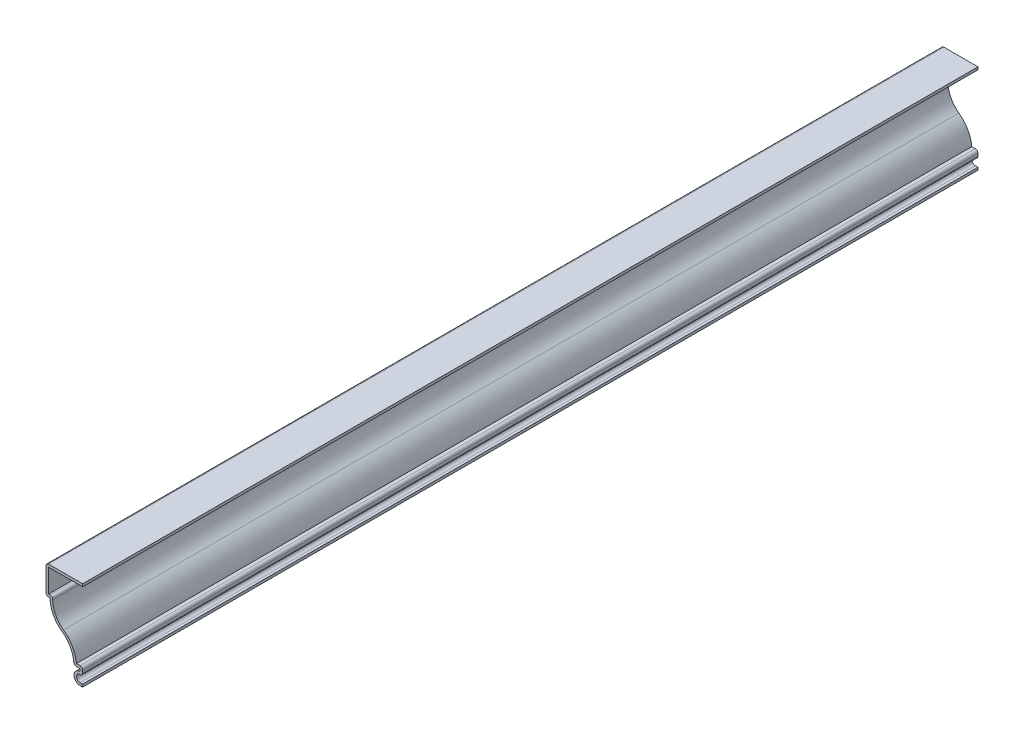
ISO-10303-21;
HEADER;
FILE_DESCRIPTION(('STEP AP214'),'2;1');
FILE_NAME('part.step','',(''),(''),'','','');
FILE_SCHEMA(('AUTOMOTIVE_DESIGN { 1 0 10303 214 1 1 1 1 }'));
ENDSEC;
DATA;
#1=APPLICATION_CONTEXT('core data for automotive mechanical design processes');
#2=APPLICATION_PROTOCOL_DEFINITION('international standard','automotive_design',2000,#1);
#3=PRODUCT_CONTEXT('',#1,'mechanical');
#4=PRODUCT('Part','Part','',(#3));
#5=PRODUCT_RELATED_PRODUCT_CATEGORY('part','',(#4));
#6=PRODUCT_DEFINITION_FORMATION('','',#4);
#7=PRODUCT_DEFINITION_CONTEXT('part definition',#1,'design');
#8=PRODUCT_DEFINITION('design','',#6,#7);
#9=PRODUCT_DEFINITION_SHAPE('','',#8);
#10=(LENGTH_UNIT() NAMED_UNIT(*) SI_UNIT(.MILLI.,.METRE.));
#11=(NAMED_UNIT(*) PLANE_ANGLE_UNIT() SI_UNIT($,.RADIAN.));
#12=(NAMED_UNIT(*) SI_UNIT($,.STERADIAN.) SOLID_ANGLE_UNIT());
#13=UNCERTAINTY_MEASURE_WITH_UNIT(LENGTH_MEASURE(1.E-05),#10,'distance_accuracy_value','');
#14=(GEOMETRIC_REPRESENTATION_CONTEXT(3) GLOBAL_UNCERTAINTY_ASSIGNED_CONTEXT((#13)) GLOBAL_UNIT_ASSIGNED_CONTEXT((#10,
#11,#12)) REPRESENTATION_CONTEXT('',''));
#15=CARTESIAN_POINT('',(0.,0.,0.));
#16=DIRECTION('',(0.,0.,1.));
#17=DIRECTION('',(1.,0.,0.));
#18=AXIS2_PLACEMENT_3D('',#15,#16,#17);
#19=CARTESIAN_POINT('',(-14.2875,33.909,-349.25));
#20=DIRECTION('',(0.,-1.,0.));
#21=DIRECTION('',(1.,0.,0.));
#22=AXIS2_PLACEMENT_3D('',#19,#20,#21);
#23=PLANE('',#22);
#24=DIRECTION('',(1.,0.,0.));
#25=VECTOR('',#24,1.);
#26=CARTESIAN_POINT('',(-14.2875,33.909,0.));
#27=LINE('',#26,#25);
#28=CARTESIAN_POINT('',(-13.2715,33.909,0.));
#29=VERTEX_POINT('',#28);
#30=CARTESIAN_POINT('',(0.,33.909,0.));
#31=VERTEX_POINT('',#30);
#32=EDGE_CURVE('E281',#29,#31,#27,.T.);
#33=ORIENTED_EDGE('',*,*,#32,.F.);
#34=DIRECTION('',(0.,0.,1.));
#35=VECTOR('',#34,1.);
#36=CARTESIAN_POINT('',(-13.2715,33.909,-349.25));
#37=LINE('',#36,#35);
#38=CARTESIAN_POINT('',(-13.2715,33.909,-349.25));
#39=VERTEX_POINT('',#38);
#40=EDGE_CURVE('E233',#39,#29,#37,.T.);
#41=ORIENTED_EDGE('',*,*,#40,.F.);
#42=DIRECTION('',(1.,0.,0.));
#43=VECTOR('',#42,1.);
#44=CARTESIAN_POINT('',(-14.2875,33.909,-349.25));
#45=LINE('',#44,#43);
#46=CARTESIAN_POINT('',(0.,33.909,-349.25));
#47=VERTEX_POINT('',#46);
#48=EDGE_CURVE('E215',#39,#47,#45,.T.);
#49=ORIENTED_EDGE('',*,*,#48,.T.);
#50=DIRECTION('',(0.,0.,1.));
#51=VECTOR('',#50,1.);
#52=CARTESIAN_POINT('',(0.,33.909,-349.25));
#53=LINE('',#52,#51);
#54=EDGE_CURVE('E223',#47,#31,#53,.T.);
#55=ORIENTED_EDGE('',*,*,#54,.T.);
#56=EDGE_LOOP('',(#33,#41,#49,#55));
#57=FACE_BOUND('',#56,.T.);
#58=ADVANCED_FACE('F35',(#57),#23,.T.);
#59=CARTESIAN_POINT('',(-13.2715,23.8125,-349.25));
#60=DIRECTION('',(1.,0.,0.));
#61=DIRECTION('',(0.,1.,0.));
#62=AXIS2_PLACEMENT_3D('',#59,#60,#61);
#63=PLANE('',#62);
#64=DIRECTION('',(0.,1.,0.));
#65=VECTOR('',#64,1.);
#66=CARTESIAN_POINT('',(-13.2715,23.8125,0.));
#67=LINE('',#66,#65);
#68=CARTESIAN_POINT('',(-13.2715,24.8285,0.));
#69=VERTEX_POINT('',#68);
#70=EDGE_CURVE('E234',#69,#29,#67,.T.);
#71=ORIENTED_EDGE('',*,*,#70,.F.);
#72=DIRECTION('',(0.,0.,1.));
#73=VECTOR('',#72,1.);
#74=CARTESIAN_POINT('',(-13.2715,24.8285,-349.25));
#75=LINE('',#74,#73);
#76=CARTESIAN_POINT('',(-13.2715,24.8285,-349.25));
#77=VERTEX_POINT('',#76);
#78=EDGE_CURVE('E326',#77,#69,#75,.T.);
#79=ORIENTED_EDGE('',*,*,#78,.F.);
#80=DIRECTION('',(0.,1.,0.));
#81=VECTOR('',#80,1.);
#82=CARTESIAN_POINT('',(-13.2715,23.8125,-349.25));
#83=LINE('',#82,#81);
#84=EDGE_CURVE('E231',#77,#39,#83,.T.);
#85=ORIENTED_EDGE('',*,*,#84,.T.);
#86=ORIENTED_EDGE('',*,*,#40,.T.);
#87=EDGE_LOOP('',(#71,#79,#85,#86));
#88=FACE_BOUND('',#87,.T.);
#89=ADVANCED_FACE('F426',(#88),#63,.T.);
#90=CARTESIAN_POINT('',(-12.7,24.8285,-349.25));
#91=DIRECTION('',(0.,1.,0.));
#92=DIRECTION('',(-1.,0.,0.));
#93=AXIS2_PLACEMENT_3D('',#90,#91,#92);
#94=PLANE('',#93);
#95=DIRECTION('',(-1.,0.,0.));
#96=VECTOR('',#95,1.);
#97=CARTESIAN_POINT('',(-12.7,24.8285,0.));
#98=LINE('',#97,#96);
#99=CARTESIAN_POINT('',(-12.7,24.8285,0.));
#100=VERTEX_POINT('',#99);
#101=EDGE_CURVE('E237',#100,#69,#98,.T.);
#102=ORIENTED_EDGE('',*,*,#101,.F.);
#103=DIRECTION('',(0.,0.,1.));
#104=VECTOR('',#103,1.);
#105=CARTESIAN_POINT('',(-12.7,24.8285,-349.25));
#106=LINE('',#105,#104);
#107=CARTESIAN_POINT('',(-12.7,24.8285,-349.25));
#108=VERTEX_POINT('',#107);
#109=EDGE_CURVE('E397',#100,#108,#106,.F.);
#110=ORIENTED_EDGE('',*,*,#109,.T.);
#111=DIRECTION('',(-1.,0.,0.));
#112=VECTOR('',#111,1.);
#113=CARTESIAN_POINT('',(-12.7,24.8285,-349.25));
#114=LINE('',#113,#112);
#115=EDGE_CURVE('E278',#108,#77,#114,.T.);
#116=ORIENTED_EDGE('',*,*,#115,.T.);
#117=ORIENTED_EDGE('',*,*,#78,.T.);
#118=EDGE_LOOP('',(#102,#110,#116,#117));
#119=FACE_BOUND('',#118,.T.);
#120=ADVANCED_FACE('F517',(#119),#94,.T.);
#121=CARTESIAN_POINT('',(-1.5875,23.8125,-349.25));
#122=DIRECTION('',(0.,0.,1.));
#123=DIRECTION('',(1.,0.,0.));
#124=AXIS2_PLACEMENT_3D('',#121,#122,#123);
#125=CYLINDRICAL_SURFACE('',#124,10.0965);
#126=CARTESIAN_POINT('',(-1.5875,23.8125,-349.25));
#127=DIRECTION('',(0.,0.,1.));
#128=DIRECTION('',(1.,0.,0.));
#129=AXIS2_PLACEMENT_3D('',#126,#127,#128);
#130=CIRCLE('',#129,10.0965);
#131=CARTESIAN_POINT('',(-7.45789357142857,15.5980133108313,-349.25));
#132=VERTEX_POINT('',#131);
#133=CARTESIAN_POINT('',(-11.684,23.8125,-349.25));
#134=VERTEX_POINT('',#133);
#135=EDGE_CURVE('E275',#132,#134,#130,.F.);
#136=ORIENTED_EDGE('',*,*,#135,.T.);
#137=DIRECTION('',(0.,0.,1.));
#138=VECTOR('',#137,1.);
#139=CARTESIAN_POINT('',(-11.684,23.8125,-349.25));
#140=LINE('',#139,#138);
#141=CARTESIAN_POINT('',(-11.684,23.8125,0.));
#142=VERTEX_POINT('',#141);
#143=EDGE_CURVE('E394',#134,#142,#140,.T.);
#144=ORIENTED_EDGE('',*,*,#143,.T.);
#145=CARTESIAN_POINT('',(-1.5875,23.8125,0.));
#146=DIRECTION('',(0.,0.,1.));
#147=DIRECTION('',(1.,0.,0.));
#148=AXIS2_PLACEMENT_3D('',#145,#146,#147);
#149=CIRCLE('',#148,10.0965);
#150=CARTESIAN_POINT('',(-7.45789357142857,15.5980133108313,0.));
#151=VERTEX_POINT('',#150);
#152=EDGE_CURVE('E320',#151,#142,#149,.F.);
#153=ORIENTED_EDGE('',*,*,#152,.F.);
#154=DIRECTION('',(0.,0.,1.));
#155=VECTOR('',#154,1.);
#156=CARTESIAN_POINT('',(-7.45789357142857,15.5980133108313,-349.25));
#157=LINE('',#156,#155);
#158=EDGE_CURVE('E329',#132,#151,#157,.T.);
#159=ORIENTED_EDGE('',*,*,#158,.F.);
#160=EDGE_LOOP('',(#136,#144,#153,#159));
#161=FACE_BOUND('',#160,.T.);
#162=ADVANCED_FACE('F437',(#161),#125,.F.);
#163=CARTESIAN_POINT('',(-14.50975,5.73029659616948,-349.25));
#164=DIRECTION('',(0.,0.,1.));
#165=DIRECTION('',(1.,0.,0.));
#166=AXIS2_PLACEMENT_3D('',#163,#164,#165);
#167=CYLINDRICAL_SURFACE('',#166,12.1285);
#168=CARTESIAN_POINT('',(-14.50975,5.73029659616948,0.));
#169=DIRECTION('',(0.,0.,1.));
#170=DIRECTION('',(1.,0.,0.));
#171=AXIS2_PLACEMENT_3D('',#168,#169,#170);
#172=CIRCLE('',#171,12.1285);
#173=CARTESIAN_POINT('',(-2.42387989272183,6.74629659616948,0.));
#174=VERTEX_POINT('',#173);
#175=EDGE_CURVE('E317',#174,#151,#172,.T.);
#176=ORIENTED_EDGE('',*,*,#175,.F.);
#177=DIRECTION('',(0.,0.,1.));
#178=VECTOR('',#177,1.);
#179=CARTESIAN_POINT('',(-2.42387989272183,6.74629659616948,-349.25));
#180=LINE('',#179,#178);
#181=CARTESIAN_POINT('',(-2.42387989272183,6.74629659616948,-349.25));
#182=VERTEX_POINT('',#181);
#183=EDGE_CURVE('E331',#182,#174,#180,.T.);
#184=ORIENTED_EDGE('',*,*,#183,.F.);
#185=CARTESIAN_POINT('',(-14.50975,5.73029659616948,-349.25));
#186=DIRECTION('',(0.,0.,1.));
#187=DIRECTION('',(1.,0.,0.));
#188=AXIS2_PLACEMENT_3D('',#185,#186,#187);
#189=CIRCLE('',#188,12.1285);
#190=EDGE_CURVE('E272',#182,#132,#189,.T.);
#191=ORIENTED_EDGE('',*,*,#190,.T.);
#192=ORIENTED_EDGE('',*,*,#158,.T.);
#193=EDGE_LOOP('',(#176,#184,#191,#192));
#194=FACE_BOUND('',#193,.T.);
#195=ADVANCED_FACE('F442',(#194),#167,.T.);
#196=CARTESIAN_POINT('',(-1.016,6.74629659616948,-349.25));
#197=DIRECTION('',(0.,1.,0.));
#198=DIRECTION('',(0.,0.,1.));
#199=AXIS2_PLACEMENT_3D('',#196,#197,#198);
#200=PLANE('',#199);
#201=DIRECTION('',(1.,0.,0.));
#202=VECTOR('',#201,1.);
#203=CARTESIAN_POINT('',(-1.016,6.74629659616948,0.));
#204=LINE('',#203,#202);
#205=CARTESIAN_POINT('',(-1.016,6.74629659616948,0.));
#206=VERTEX_POINT('',#205);
#207=EDGE_CURVE('E315',#206,#174,#204,.F.);
#208=ORIENTED_EDGE('',*,*,#207,.F.);
#209=DIRECTION('',(0.,0.,1.));
#210=VECTOR('',#209,1.);
#211=CARTESIAN_POINT('',(-1.016,6.74629659616948,-349.25));
#212=LINE('',#211,#210);
#213=CARTESIAN_POINT('',(-1.016,6.74629659616948,-349.25));
#214=VERTEX_POINT('',#213);
#215=EDGE_CURVE('E387',#206,#214,#212,.F.);
#216=ORIENTED_EDGE('',*,*,#215,.T.);
#217=DIRECTION('',(1.,0.,0.));
#218=VECTOR('',#217,1.);
#219=CARTESIAN_POINT('',(-1.016,6.74629659616948,-349.25));
#220=LINE('',#219,#218);
#221=EDGE_CURVE('E270',#214,#182,#220,.F.);
#222=ORIENTED_EDGE('',*,*,#221,.T.);
#223=ORIENTED_EDGE('',*,*,#183,.T.);
#224=EDGE_LOOP('',(#208,#216,#222,#223));
#225=FACE_BOUND('',#224,.T.);
#226=ADVANCED_FACE('F639',(#225),#200,.T.);
#227=CARTESIAN_POINT('',(0.,5.73029659616948,-349.25));
#228=DIRECTION('',(1.,0.,0.));
#229=DIRECTION('',(0.,1.,0.));
#230=AXIS2_PLACEMENT_3D('',#227,#228,#229);
#231=PLANE('',#230);
#232=DIRECTION('',(0.,1.,0.));
#233=VECTOR('',#232,1.);
#234=CARTESIAN_POINT('',(0.,5.73029659616948,0.));
#235=LINE('',#234,#233);
#236=CARTESIAN_POINT('',(0.,4.7625,0.));
#237=VERTEX_POINT('',#236);
#238=CARTESIAN_POINT('',(0.,5.73029659616948,0.));
#239=VERTEX_POINT('',#238);
#240=EDGE_CURVE('E312',#237,#239,#235,.T.);
#241=ORIENTED_EDGE('',*,*,#240,.F.);
#242=DIRECTION('',(0.,0.,1.));
#243=VECTOR('',#242,1.);
#244=CARTESIAN_POINT('',(0.,4.7625,-349.25));
#245=LINE('',#244,#243);
#246=CARTESIAN_POINT('',(0.,4.7625,-349.25));
#247=VERTEX_POINT('',#246);
#248=EDGE_CURVE('E374',#237,#247,#245,.F.);
#249=ORIENTED_EDGE('',*,*,#248,.T.);
#250=DIRECTION('',(0.,1.,0.));
#251=VECTOR('',#250,1.);
#252=CARTESIAN_POINT('',(0.,5.73029659616948,-349.25));
#253=LINE('',#252,#251);
#254=CARTESIAN_POINT('',(0.,5.73029659616948,-349.25));
#255=VERTEX_POINT('',#254);
#256=EDGE_CURVE('E267',#247,#255,#253,.T.);
#257=ORIENTED_EDGE('',*,*,#256,.T.);
#258=DIRECTION('',(0.,0.,1.));
#259=VECTOR('',#258,1.);
#260=CARTESIAN_POINT('',(0.,5.73029659616948,-349.25));
#261=LINE('',#260,#259);
#262=EDGE_CURVE('E371',#255,#239,#261,.T.);
#263=ORIENTED_EDGE('',*,*,#262,.T.);
#264=EDGE_LOOP('',(#241,#249,#257,#263));
#265=FACE_BOUND('',#264,.T.);
#266=ADVANCED_FACE('F453',(#265),#231,.T.);
#267=CARTESIAN_POINT('',(-1.016,2.38125,-349.25));
#268=DIRECTION('',(0.,0.,1.));
#269=DIRECTION('',(1.,0.,0.));
#270=AXIS2_PLACEMENT_3D('',#267,#268,#269);
#271=CYLINDRICAL_SURFACE('',#270,1.36525);
#272=CARTESIAN_POINT('',(-1.016,2.38125,-349.25));
#273=DIRECTION('',(0.,0.,1.));
#274=DIRECTION('',(1.,0.,0.));
#275=AXIS2_PLACEMENT_3D('',#272,#273,#274);
#276=CIRCLE('',#275,1.36525);
#277=CARTESIAN_POINT('',(-1.016,1.016,-349.25));
#278=VERTEX_POINT('',#277);
#279=CARTESIAN_POINT('',(-1.016,3.7465,-349.25));
#280=VERTEX_POINT('',#279);
#281=EDGE_CURVE('E264',#278,#280,#276,.F.);
#282=ORIENTED_EDGE('',*,*,#281,.T.);
#283=DIRECTION('',(0.,0.,1.));
#284=VECTOR('',#283,1.);
#285=CARTESIAN_POINT('',(-1.016,3.7465,-349.25));
#286=LINE('',#285,#284);
#287=CARTESIAN_POINT('',(-1.016,3.7465,0.));
#288=VERTEX_POINT('',#287);
#289=EDGE_CURVE('E325',#280,#288,#286,.T.);
#290=ORIENTED_EDGE('',*,*,#289,.T.);
#291=CARTESIAN_POINT('',(-1.016,2.38125,0.));
#292=DIRECTION('',(0.,0.,1.));
#293=DIRECTION('',(1.,0.,0.));
#294=AXIS2_PLACEMENT_3D('',#291,#292,#293);
#295=CIRCLE('',#294,1.36525);
#296=CARTESIAN_POINT('',(-1.016,1.016,0.));
#297=VERTEX_POINT('',#296);
#298=EDGE_CURVE('E309',#297,#288,#295,.F.);
#299=ORIENTED_EDGE('',*,*,#298,.F.);
#300=DIRECTION('',(0.,0.,1.));
#301=VECTOR('',#300,1.);
#302=CARTESIAN_POINT('',(-1.016,1.016,-349.25));
#303=LINE('',#302,#301);
#304=EDGE_CURVE('E334',#278,#297,#303,.T.);
#305=ORIENTED_EDGE('',*,*,#304,.F.);
#306=EDGE_LOOP('',(#282,#290,#299,#305));
#307=FACE_BOUND('',#306,.T.);
#308=ADVANCED_FACE('F461',(#307),#271,.F.);
#309=CARTESIAN_POINT('',(-1.016,1.016,-349.25));
#310=DIRECTION('',(0.,1.,0.));
#311=DIRECTION('',(0.,0.,1.));
#312=AXIS2_PLACEMENT_3D('',#309,#310,#311);
#313=PLANE('',#312);
#314=DIRECTION('',(1.,0.,0.));
#315=VECTOR('',#314,1.);
#316=CARTESIAN_POINT('',(-1.016,1.016,0.));
#317=LINE('',#316,#315);
#318=CARTESIAN_POINT('',(0.,1.016,0.));
#319=VERTEX_POINT('',#318);
#320=EDGE_CURVE('E306',#319,#297,#317,.F.);
#321=ORIENTED_EDGE('',*,*,#320,.F.);
#322=DIRECTION('',(0.,0.,1.));
#323=VECTOR('',#322,1.);
#324=CARTESIAN_POINT('',(0.,1.016,-349.25));
#325=LINE('',#324,#323);
#326=CARTESIAN_POINT('',(0.,1.016,-349.25));
#327=VERTEX_POINT('',#326);
#328=EDGE_CURVE('E336',#327,#319,#325,.T.);
#329=ORIENTED_EDGE('',*,*,#328,.F.);
#330=DIRECTION('',(1.,0.,0.));
#331=VECTOR('',#330,1.);
#332=CARTESIAN_POINT('',(-1.016,1.016,-349.25));
#333=LINE('',#332,#331);
#334=EDGE_CURVE('E261',#327,#278,#333,.F.);
#335=ORIENTED_EDGE('',*,*,#334,.T.);
#336=ORIENTED_EDGE('',*,*,#304,.T.);
#337=EDGE_LOOP('',(#321,#329,#335,#336));
#338=FACE_BOUND('',#337,.T.);
#339=ADVANCED_FACE('F466',(#338),#313,.T.);
#340=CARTESIAN_POINT('',(0.,1.016,-349.25));
#341=DIRECTION('',(-1.,0.,0.));
#342=DIRECTION('',(0.,0.,1.));
#343=AXIS2_PLACEMENT_3D('',#340,#341,#342);
#344=PLANE('',#343);
#345=DIRECTION('',(0.,-1.,0.));
#346=VECTOR('',#345,1.);
#347=CARTESIAN_POINT('',(0.,1.016,0.));
#348=LINE('',#347,#346);
#349=CARTESIAN_POINT('',(0.,0.,0.));
#350=VERTEX_POINT('',#349);
#351=EDGE_CURVE('E304',#319,#350,#348,.T.);
#352=ORIENTED_EDGE('',*,*,#351,.T.);
#353=DIRECTION('',(0.,0.,1.));
#354=VECTOR('',#353,1.);
#355=CARTESIAN_POINT('',(0.,0.,-349.25));
#356=LINE('',#355,#354);
#357=CARTESIAN_POINT('',(0.,0.,-349.25));
#358=VERTEX_POINT('',#357);
#359=EDGE_CURVE('E338',#358,#350,#356,.T.);
#360=ORIENTED_EDGE('',*,*,#359,.F.);
#361=DIRECTION('',(0.,-1.,0.));
#362=VECTOR('',#361,1.);
#363=CARTESIAN_POINT('',(0.,1.016,-349.25));
#364=LINE('',#363,#362);
#365=EDGE_CURVE('E259',#327,#358,#364,.T.);
#366=ORIENTED_EDGE('',*,*,#365,.F.);
#367=ORIENTED_EDGE('',*,*,#328,.T.);
#368=EDGE_LOOP('',(#352,#360,#366,#367));
#369=FACE_BOUND('',#368,.T.);
#370=ADVANCED_FACE('F471',(#369),#344,.F.);
#371=CARTESIAN_POINT('',(-1.016,0.,-349.25));
#372=DIRECTION('',(0.,1.,0.));
#373=DIRECTION('',(0.,0.,1.));
#374=AXIS2_PLACEMENT_3D('',#371,#372,#373);
#375=PLANE('',#374);
#376=DIRECTION('',(-1.,0.,0.));
#377=VECTOR('',#376,1.);
#378=CARTESIAN_POINT('',(-1.016,0.,0.));
#379=LINE('',#378,#377);
#380=CARTESIAN_POINT('',(-1.016,0.,0.));
#381=VERTEX_POINT('',#380);
#382=EDGE_CURVE('E302',#350,#381,#379,.T.);
#383=ORIENTED_EDGE('',*,*,#382,.T.);
#384=DIRECTION('',(0.,0.,1.));
#385=VECTOR('',#384,1.);
#386=CARTESIAN_POINT('',(-1.016,0.,-349.25));
#387=LINE('',#386,#385);
#388=CARTESIAN_POINT('',(-1.016,0.,-349.25));
#389=VERTEX_POINT('',#388);
#390=EDGE_CURVE('E341',#389,#381,#387,.T.);
#391=ORIENTED_EDGE('',*,*,#390,.F.);
#392=DIRECTION('',(-1.,0.,0.));
#393=VECTOR('',#392,1.);
#394=CARTESIAN_POINT('',(-1.016,0.,-349.25));
#395=LINE('',#394,#393);
#396=EDGE_CURVE('E257',#358,#389,#395,.T.);
#397=ORIENTED_EDGE('',*,*,#396,.F.);
#398=ORIENTED_EDGE('',*,*,#359,.T.);
#399=EDGE_LOOP('',(#383,#391,#397,#398));
#400=FACE_BOUND('',#399,.T.);
#401=ADVANCED_FACE('F477',(#400),#375,.F.);
#402=CARTESIAN_POINT('',(-1.016,2.38125,-349.25));
#403=DIRECTION('',(0.,0.,1.));
#404=DIRECTION('',(1.,0.,0.));
#405=AXIS2_PLACEMENT_3D('',#402,#403,#404);
#406=CYLINDRICAL_SURFACE('',#405,2.38125);
#407=CARTESIAN_POINT('',(-1.016,2.38125,0.));
#408=DIRECTION('',(0.,0.,-1.));
#409=DIRECTION('',(1.,0.,0.));
#410=AXIS2_PLACEMENT_3D('',#407,#408,#409);
#411=CIRCLE('',#410,2.38125);
#412=CARTESIAN_POINT('',(-1.016,4.7625,0.));
#413=VERTEX_POINT('',#412);
#414=EDGE_CURVE('E300',#381,#413,#411,.T.);
#415=ORIENTED_EDGE('',*,*,#414,.T.);
#416=DIRECTION('',(0.,0.,1.));
#417=VECTOR('',#416,1.);
#418=CARTESIAN_POINT('',(-1.016,4.7625,-349.25));
#419=LINE('',#418,#417);
#420=CARTESIAN_POINT('',(-1.016,4.7625,-349.25));
#421=VERTEX_POINT('',#420);
#422=EDGE_CURVE('E344',#421,#413,#419,.T.);
#423=ORIENTED_EDGE('',*,*,#422,.F.);
#424=CARTESIAN_POINT('',(-1.016,2.38125,-349.25));
#425=DIRECTION('',(0.,0.,-1.));
#426=DIRECTION('',(1.,0.,0.));
#427=AXIS2_PLACEMENT_3D('',#424,#425,#426);
#428=CIRCLE('',#427,2.38125);
#429=EDGE_CURVE('E255',#389,#421,#428,.T.);
#430=ORIENTED_EDGE('',*,*,#429,.F.);
#431=ORIENTED_EDGE('',*,*,#390,.T.);
#432=EDGE_LOOP('',(#415,#423,#430,#431));
#433=FACE_BOUND('',#432,.T.);
#434=ADVANCED_FACE('F481',(#433),#406,.T.);
#435=CARTESIAN_POINT('',(-1.016,5.73029659616948,-349.25));
#436=DIRECTION('',(1.,0.,0.));
#437=DIRECTION('',(0.,1.,0.));
#438=AXIS2_PLACEMENT_3D('',#435,#436,#437);
#439=PLANE('',#438);
#440=DIRECTION('',(0.,1.,0.));
#441=VECTOR('',#440,1.);
#442=CARTESIAN_POINT('',(-1.016,5.73029659616948,0.));
#443=LINE('',#442,#441);
#444=CARTESIAN_POINT('',(-1.016,5.73029659616948,0.));
#445=VERTEX_POINT('',#444);
#446=EDGE_CURVE('E298',#413,#445,#443,.T.);
#447=ORIENTED_EDGE('',*,*,#446,.T.);
#448=DIRECTION('',(0.,0.,1.));
#449=VECTOR('',#448,1.);
#450=CARTESIAN_POINT('',(-1.016,5.73029659616948,-349.25));
#451=LINE('',#450,#449);
#452=CARTESIAN_POINT('',(-1.016,5.73029659616948,-349.25));
#453=VERTEX_POINT('',#452);
#454=EDGE_CURVE('E347',#453,#445,#451,.T.);
#455=ORIENTED_EDGE('',*,*,#454,.F.);
#456=DIRECTION('',(0.,1.,0.));
#457=VECTOR('',#456,1.);
#458=CARTESIAN_POINT('',(-1.016,5.73029659616948,-349.25));
#459=LINE('',#458,#457);
#460=EDGE_CURVE('E253',#421,#453,#459,.T.);
#461=ORIENTED_EDGE('',*,*,#460,.F.);
#462=ORIENTED_EDGE('',*,*,#422,.T.);
#463=EDGE_LOOP('',(#447,#455,#461,#462));
#464=FACE_BOUND('',#463,.T.);
#465=ADVANCED_FACE('F486',(#464),#439,.F.);
#466=CARTESIAN_POINT('',(-1.016,5.73029659616948,-349.25));
#467=DIRECTION('',(0.,1.,0.));
#468=DIRECTION('',(0.,0.,1.));
#469=AXIS2_PLACEMENT_3D('',#466,#467,#468);
#470=PLANE('',#469);
#471=DIRECTION('',(-1.,0.,0.));
#472=VECTOR('',#471,1.);
#473=CARTESIAN_POINT('',(-1.016,5.73029659616948,0.));
#474=LINE('',#473,#472);
#475=CARTESIAN_POINT('',(-2.42387989272183,5.73029659616948,0.));
#476=VERTEX_POINT('',#475);
#477=EDGE_CURVE('E295',#445,#476,#474,.T.);
#478=ORIENTED_EDGE('',*,*,#477,.T.);
#479=DIRECTION('',(0.,0.,1.));
#480=VECTOR('',#479,1.);
#481=CARTESIAN_POINT('',(-2.42387989272183,5.73029659616948,-349.25));
#482=LINE('',#481,#480);
#483=CARTESIAN_POINT('',(-2.42387989272183,5.73029659616948,-349.25));
#484=VERTEX_POINT('',#483);
#485=EDGE_CURVE('E392',#476,#484,#482,.F.);
#486=ORIENTED_EDGE('',*,*,#485,.T.);
#487=DIRECTION('',(-1.,0.,0.));
#488=VECTOR('',#487,1.);
#489=CARTESIAN_POINT('',(-1.016,5.73029659616948,-349.25));
#490=LINE('',#489,#488);
#491=EDGE_CURVE('E250',#453,#484,#490,.T.);
#492=ORIENTED_EDGE('',*,*,#491,.F.);
#493=ORIENTED_EDGE('',*,*,#454,.T.);
#494=EDGE_LOOP('',(#478,#486,#492,#493));
#495=FACE_BOUND('',#494,.T.);
#496=ADVANCED_FACE('F510',(#495),#470,.F.);
#497=CARTESIAN_POINT('',(-14.50975,5.73029659616948,-349.25));
#498=DIRECTION('',(0.,0.,1.));
#499=DIRECTION('',(1.,0.,0.));
#500=AXIS2_PLACEMENT_3D('',#497,#498,#499);
#501=CYLINDRICAL_SURFACE('',#500,11.1125);
#502=CARTESIAN_POINT('',(-14.50975,5.73029659616948,-349.25));
#503=DIRECTION('',(0.,0.,1.));
#504=DIRECTION('',(1.,0.,0.));
#505=AXIS2_PLACEMENT_3D('',#502,#503,#504);
#506=CIRCLE('',#505,11.1125);
#507=CARTESIAN_POINT('',(-3.43630880223204,6.6611866485255,-349.25));
#508=VERTEX_POINT('',#507);
#509=CARTESIAN_POINT('',(-8.048625,14.7713982980847,-349.25));
#510=VERTEX_POINT('',#509);
#511=EDGE_CURVE('E248',#508,#510,#506,.T.);
#512=ORIENTED_EDGE('',*,*,#511,.F.);
#513=DIRECTION('',(0.,0.,1.));
#514=VECTOR('',#513,1.);
#515=CARTESIAN_POINT('',(-3.43630880223204,6.6611866485255,-349.25));
#516=LINE('',#515,#514);
#517=CARTESIAN_POINT('',(-3.43630880223204,6.6611866485255,0.));
#518=VERTEX_POINT('',#517);
#519=EDGE_CURVE('E389',#508,#518,#516,.T.);
#520=ORIENTED_EDGE('',*,*,#519,.T.);
#521=CARTESIAN_POINT('',(-14.50975,5.73029659616948,0.));
#522=DIRECTION('',(0.,0.,1.));
#523=DIRECTION('',(1.,0.,0.));
#524=AXIS2_PLACEMENT_3D('',#521,#522,#523);
#525=CIRCLE('',#524,11.1125);
#526=CARTESIAN_POINT('',(-8.048625,14.7713982980847,0.));
#527=VERTEX_POINT('',#526);
#528=EDGE_CURVE('E293',#518,#527,#525,.T.);
#529=ORIENTED_EDGE('',*,*,#528,.T.);
#530=DIRECTION('',(0.,0.,1.));
#531=VECTOR('',#530,1.);
#532=CARTESIAN_POINT('',(-8.048625,14.7713982980847,-349.25));
#533=LINE('',#532,#531);
#534=EDGE_CURVE('E350',#510,#527,#533,.T.);
#535=ORIENTED_EDGE('',*,*,#534,.F.);
#536=EDGE_LOOP('',(#512,#520,#529,#535));
#537=FACE_BOUND('',#536,.T.);
#538=ADVANCED_FACE('F497',(#537),#501,.F.);
#539=CARTESIAN_POINT('',(-1.5875,23.8125,-349.25));
#540=DIRECTION('',(0.,0.,1.));
#541=DIRECTION('',(1.,0.,0.));
#542=AXIS2_PLACEMENT_3D('',#539,#540,#541);
#543=CYLINDRICAL_SURFACE('',#542,11.1125);
#544=CARTESIAN_POINT('',(-1.5875,23.8125,0.));
#545=DIRECTION('',(0.,0.,-1.));
#546=DIRECTION('',(-1.,0.,0.));
#547=AXIS2_PLACEMENT_3D('',#544,#545,#546);
#548=CIRCLE('',#547,11.1125);
#549=CARTESIAN_POINT('',(-12.7,23.8125,0.));
#550=VERTEX_POINT('',#549);
#551=EDGE_CURVE('E291',#527,#550,#548,.T.);
#552=ORIENTED_EDGE('',*,*,#551,.T.);
#553=DIRECTION('',(0.,0.,1.));
#554=VECTOR('',#553,1.);
#555=CARTESIAN_POINT('',(-12.7,23.8125,-349.25));
#556=LINE('',#555,#554);
#557=CARTESIAN_POINT('',(-12.7,23.8125,-349.25));
#558=VERTEX_POINT('',#557);
#559=EDGE_CURVE('E353',#558,#550,#556,.T.);
#560=ORIENTED_EDGE('',*,*,#559,.F.);
#561=CARTESIAN_POINT('',(-1.5875,23.8125,-349.25));
#562=DIRECTION('',(0.,0.,-1.));
#563=DIRECTION('',(-1.,0.,0.));
#564=AXIS2_PLACEMENT_3D('',#561,#562,#563);
#565=CIRCLE('',#564,11.1125);
#566=EDGE_CURVE('E246',#510,#558,#565,.T.);
#567=ORIENTED_EDGE('',*,*,#566,.F.);
#568=ORIENTED_EDGE('',*,*,#534,.T.);
#569=EDGE_LOOP('',(#552,#560,#567,#568));
#570=FACE_BOUND('',#569,.T.);
#571=ADVANCED_FACE('F502',(#570),#543,.T.);
#572=CARTESIAN_POINT('',(-12.7,23.8125,-349.25));
#573=DIRECTION('',(0.,1.,0.));
#574=DIRECTION('',(-1.,0.,0.));
#575=AXIS2_PLACEMENT_3D('',#572,#573,#574);
#576=PLANE('',#575);
#577=DIRECTION('',(-1.,0.,0.));
#578=VECTOR('',#577,1.);
#579=CARTESIAN_POINT('',(-12.7,23.8125,0.));
#580=LINE('',#579,#578);
#581=CARTESIAN_POINT('',(-13.2715,23.8125,0.));
#582=VERTEX_POINT('',#581);
#583=EDGE_CURVE('E288',#550,#582,#580,.T.);
#584=ORIENTED_EDGE('',*,*,#583,.T.);
#585=DIRECTION('',(0.,0.,1.));
#586=VECTOR('',#585,1.);
#587=CARTESIAN_POINT('',(-13.2715,23.8125,-349.25));
#588=LINE('',#587,#586);
#589=CARTESIAN_POINT('',(-13.2715,23.8125,-349.25));
#590=VERTEX_POINT('',#589);
#591=EDGE_CURVE('E43',#582,#590,#588,.F.);
#592=ORIENTED_EDGE('',*,*,#591,.T.);
#593=DIRECTION('',(-1.,0.,0.));
#594=VECTOR('',#593,1.);
#595=CARTESIAN_POINT('',(-12.7,23.8125,-349.25));
#596=LINE('',#595,#594);
#597=EDGE_CURVE('E243',#558,#590,#596,.T.);
#598=ORIENTED_EDGE('',*,*,#597,.F.);
#599=ORIENTED_EDGE('',*,*,#559,.T.);
#600=EDGE_LOOP('',(#584,#592,#598,#599));
#601=FACE_BOUND('',#600,.T.);
#602=ADVANCED_FACE('F405',(#601),#576,.F.);
#603=CARTESIAN_POINT('',(-14.2875,23.8125,-349.25));
#604=DIRECTION('',(1.,0.,0.));
#605=DIRECTION('',(0.,1.,0.));
#606=AXIS2_PLACEMENT_3D('',#603,#604,#605);
#607=PLANE('',#606);
#608=DIRECTION('',(0.,1.,0.));
#609=VECTOR('',#608,1.);
#610=CARTESIAN_POINT('',(-14.2875,23.8125,-349.25));
#611=LINE('',#610,#609);
#612=CARTESIAN_POINT('',(-14.2875,24.8285,-349.25));
#613=VERTEX_POINT('',#612);
#614=CARTESIAN_POINT('',(-14.2875,33.909,-349.25));
#615=VERTEX_POINT('',#614);
#616=EDGE_CURVE('E241',#613,#615,#611,.T.);
#617=ORIENTED_EDGE('',*,*,#616,.F.);
#618=DIRECTION('',(0.,0.,1.));
#619=VECTOR('',#618,1.);
#620=CARTESIAN_POINT('',(-14.2875,24.8285,-349.25));
#621=LINE('',#620,#619);
#622=CARTESIAN_POINT('',(-14.2875,24.8285,0.));
#623=VERTEX_POINT('',#622);
#624=EDGE_CURVE('E400',#613,#623,#621,.T.);
#625=ORIENTED_EDGE('',*,*,#624,.T.);
#626=DIRECTION('',(0.,1.,0.));
#627=VECTOR('',#626,1.);
#628=CARTESIAN_POINT('',(-14.2875,23.8125,0.));
#629=LINE('',#628,#627);
#630=CARTESIAN_POINT('',(-14.2875,33.909,0.));
#631=VERTEX_POINT('',#630);
#632=EDGE_CURVE('E286',#623,#631,#629,.T.);
#633=ORIENTED_EDGE('',*,*,#632,.T.);
#634=DIRECTION('',(0.,0.,1.));
#635=VECTOR('',#634,1.);
#636=CARTESIAN_POINT('',(-14.2875,33.909,-349.25));
#637=LINE('',#636,#635);
#638=EDGE_CURVE('E58',#631,#615,#637,.F.);
#639=ORIENTED_EDGE('',*,*,#638,.T.);
#640=EDGE_LOOP('',(#617,#625,#633,#639));
#641=FACE_BOUND('',#640,.T.);
#642=ADVANCED_FACE('F414',(#641),#607,.F.);
#643=CARTESIAN_POINT('',(-14.2875,34.925,-349.25));
#644=DIRECTION('',(0.,-1.,0.));
#645=DIRECTION('',(1.,0.,0.));
#646=AXIS2_PLACEMENT_3D('',#643,#644,#645);
#647=PLANE('',#646);
#648=DIRECTION('',(1.,0.,0.));
#649=VECTOR('',#648,1.);
#650=CARTESIAN_POINT('',(-14.2875,34.925,-349.25));
#651=LINE('',#650,#649);
#652=CARTESIAN_POINT('',(-13.2715,34.925,-349.25));
#653=VERTEX_POINT('',#652);
#654=CARTESIAN_POINT('',(0.,34.925,-349.25));
#655=VERTEX_POINT('',#654);
#656=EDGE_CURVE('E217',#653,#655,#651,.T.);
#657=ORIENTED_EDGE('',*,*,#656,.F.);
#658=DIRECTION('',(0.,0.,1.));
#659=VECTOR('',#658,1.);
#660=CARTESIAN_POINT('',(-13.2715,34.925,-349.25));
#661=LINE('',#660,#659);
#662=CARTESIAN_POINT('',(-13.2715,34.925,0.));
#663=VERTEX_POINT('',#662);
#664=EDGE_CURVE('E11',#653,#663,#661,.T.);
#665=ORIENTED_EDGE('',*,*,#664,.T.);
#666=DIRECTION('',(1.,0.,0.));
#667=VECTOR('',#666,1.);
#668=CARTESIAN_POINT('',(-14.2875,34.925,0.));
#669=LINE('',#668,#667);
#670=CARTESIAN_POINT('',(0.,34.925,0.));
#671=VERTEX_POINT('',#670);
#672=EDGE_CURVE('E284',#663,#671,#669,.T.);
#673=ORIENTED_EDGE('',*,*,#672,.T.);
#674=DIRECTION('',(0.,0.,1.));
#675=VECTOR('',#674,1.);
#676=CARTESIAN_POINT('',(0.,34.925,-349.25));
#677=LINE('',#676,#675);
#678=EDGE_CURVE('E230',#655,#671,#677,.T.);
#679=ORIENTED_EDGE('',*,*,#678,.F.);
#680=EDGE_LOOP('',(#657,#665,#673,#679));
#681=FACE_BOUND('',#680,.T.);
#682=ADVANCED_FACE('F421',(#681),#647,.F.);
#683=CARTESIAN_POINT('',(0.,34.925,-349.25));
#684=DIRECTION('',(-1.,0.,0.));
#685=DIRECTION('',(0.,0.,1.));
#686=AXIS2_PLACEMENT_3D('',#683,#684,#685);
#687=PLANE('',#686);
#688=DIRECTION('',(0.,-1.,0.));
#689=VECTOR('',#688,1.);
#690=CARTESIAN_POINT('',(0.,34.925,0.));
#691=LINE('',#690,#689);
#692=EDGE_CURVE('E226',#671,#31,#691,.T.);
#693=ORIENTED_EDGE('',*,*,#692,.T.);
#694=ORIENTED_EDGE('',*,*,#54,.F.);
#695=DIRECTION('',(0.,-1.,0.));
#696=VECTOR('',#695,1.);
#697=CARTESIAN_POINT('',(0.,34.925,-349.25));
#698=LINE('',#697,#696);
#699=EDGE_CURVE('E209',#655,#47,#698,.T.);
#700=ORIENTED_EDGE('',*,*,#699,.F.);
#701=ORIENTED_EDGE('',*,*,#678,.T.);
#702=EDGE_LOOP('',(#693,#694,#700,#701));
#703=FACE_BOUND('',#702,.T.);
#704=ADVANCED_FACE('F224',(#703),#687,.F.);
#705=CARTESIAN_POINT('',(-1.5875,23.8125,-349.25));
#706=DIRECTION('',(0.,0.,-1.));
#707=DIRECTION('',(-1.,0.,0.));
#708=AXIS2_PLACEMENT_3D('',#705,#706,#707);
#709=PLANE('',#708);
#710=ORIENTED_EDGE('',*,*,#256,.F.);
#711=CARTESIAN_POINT('',(-1.016,4.7625,-349.25));
#712=DIRECTION('',(0.,0.,-1.));
#713=DIRECTION('',(-1.,0.,0.));
#714=AXIS2_PLACEMENT_3D('',#711,#712,#713);
#715=CIRCLE('',#714,1.016);
#716=EDGE_CURVE('E385',#247,#280,#715,.T.);
#717=ORIENTED_EDGE('',*,*,#716,.T.);
#718=ORIENTED_EDGE('',*,*,#281,.F.);
#719=ORIENTED_EDGE('',*,*,#334,.F.);
#720=ORIENTED_EDGE('',*,*,#365,.T.);
#721=ORIENTED_EDGE('',*,*,#396,.T.);
#722=ORIENTED_EDGE('',*,*,#429,.T.);
#723=ORIENTED_EDGE('',*,*,#460,.T.);
#724=ORIENTED_EDGE('',*,*,#491,.T.);
#725=CARTESIAN_POINT('',(-2.42387989272183,6.74629659616948,-349.25));
#726=DIRECTION('',(0.,0.,-1.));
#727=DIRECTION('',(-1.,0.,0.));
#728=AXIS2_PLACEMENT_3D('',#725,#726,#727);
#729=CIRCLE('',#728,1.016);
#730=EDGE_CURVE('E381',#484,#508,#729,.T.);
#731=ORIENTED_EDGE('',*,*,#730,.T.);
#732=ORIENTED_EDGE('',*,*,#511,.T.);
#733=ORIENTED_EDGE('',*,*,#566,.T.);
#734=ORIENTED_EDGE('',*,*,#597,.T.);
#735=CARTESIAN_POINT('',(-13.2715,24.8285,-349.25));
#736=DIRECTION('',(0.,0.,-1.));
#737=DIRECTION('',(-1.,0.,0.));
#738=AXIS2_PLACEMENT_3D('',#735,#736,#737);
#739=CIRCLE('',#738,1.016);
#740=EDGE_CURVE('E377',#590,#613,#739,.T.);
#741=ORIENTED_EDGE('',*,*,#740,.T.);
#742=ORIENTED_EDGE('',*,*,#616,.T.);
#743=CARTESIAN_POINT('',(-13.2715,33.909,-349.25));
#744=DIRECTION('',(0.,0.,-1.));
#745=DIRECTION('',(-1.,0.,0.));
#746=AXIS2_PLACEMENT_3D('',#743,#744,#745);
#747=CIRCLE('',#746,1.016);
#748=EDGE_CURVE('E50',#615,#653,#747,.T.);
#749=ORIENTED_EDGE('',*,*,#748,.T.);
#750=ORIENTED_EDGE('',*,*,#656,.T.);
#751=ORIENTED_EDGE('',*,*,#699,.T.);
#752=ORIENTED_EDGE('',*,*,#48,.F.);
#753=ORIENTED_EDGE('',*,*,#84,.F.);
#754=ORIENTED_EDGE('',*,*,#115,.F.);
#755=CARTESIAN_POINT('',(-12.7,23.8125,-349.25));
#756=DIRECTION('',(0.,0.,-1.));
#757=DIRECTION('',(-1.,0.,0.));
#758=AXIS2_PLACEMENT_3D('',#755,#756,#757);
#759=CIRCLE('',#758,1.016);
#760=EDGE_CURVE('E379',#108,#134,#759,.T.);
#761=ORIENTED_EDGE('',*,*,#760,.T.);
#762=ORIENTED_EDGE('',*,*,#135,.F.);
#763=ORIENTED_EDGE('',*,*,#190,.F.);
#764=ORIENTED_EDGE('',*,*,#221,.F.);
#765=CARTESIAN_POINT('',(-1.016,5.73029659616948,-349.25));
#766=DIRECTION('',(0.,0.,-1.));
#767=DIRECTION('',(-1.,0.,0.));
#768=AXIS2_PLACEMENT_3D('',#765,#766,#767);
#769=CIRCLE('',#768,1.016);
#770=EDGE_CURVE('E383',#214,#255,#769,.T.);
#771=ORIENTED_EDGE('',*,*,#770,.T.);
#772=EDGE_LOOP('',(#710,#717,#718,#719,#720,#721,#722,#723,#724,#731,#732,#733,#734,#741,#742,
#749,#750,#751,#752,#753,#754,#761,#762,#763,#764,#771));
#773=FACE_BOUND('',#772,.T.);
#774=ADVANCED_FACE('F212',(#773),#709,.T.);
#775=CARTESIAN_POINT('',(-1.5875,23.8125,0.));
#776=DIRECTION('',(0.,0.,-1.));
#777=DIRECTION('',(-1.,0.,0.));
#778=AXIS2_PLACEMENT_3D('',#775,#776,#777);
#779=PLANE('',#778);
#780=ORIENTED_EDGE('',*,*,#298,.T.);
#781=CARTESIAN_POINT('',(-1.016,4.7625,0.));
#782=DIRECTION('',(0.,0.,-1.));
#783=DIRECTION('',(-1.,0.,0.));
#784=AXIS2_PLACEMENT_3D('',#781,#782,#783);
#785=CIRCLE('',#784,1.016);
#786=EDGE_CURVE('E369',#288,#237,#785,.F.);
#787=ORIENTED_EDGE('',*,*,#786,.T.);
#788=ORIENTED_EDGE('',*,*,#240,.T.);
#789=CARTESIAN_POINT('',(-1.016,5.73029659616948,0.));
#790=DIRECTION('',(0.,0.,-1.));
#791=DIRECTION('',(-1.,0.,0.));
#792=AXIS2_PLACEMENT_3D('',#789,#790,#791);
#793=CIRCLE('',#792,1.016);
#794=EDGE_CURVE('E367',#239,#206,#793,.F.);
#795=ORIENTED_EDGE('',*,*,#794,.T.);
#796=ORIENTED_EDGE('',*,*,#207,.T.);
#797=ORIENTED_EDGE('',*,*,#175,.T.);
#798=ORIENTED_EDGE('',*,*,#152,.T.);
#799=CARTESIAN_POINT('',(-12.7,23.8125,0.));
#800=DIRECTION('',(0.,0.,-1.));
#801=DIRECTION('',(-1.,0.,0.));
#802=AXIS2_PLACEMENT_3D('',#799,#800,#801);
#803=CIRCLE('',#802,1.016);
#804=EDGE_CURVE('E363',#142,#100,#803,.F.);
#805=ORIENTED_EDGE('',*,*,#804,.T.);
#806=ORIENTED_EDGE('',*,*,#101,.T.);
#807=ORIENTED_EDGE('',*,*,#70,.T.);
#808=ORIENTED_EDGE('',*,*,#32,.T.);
#809=ORIENTED_EDGE('',*,*,#692,.F.);
#810=ORIENTED_EDGE('',*,*,#672,.F.);
#811=CARTESIAN_POINT('',(-13.2715,33.909,0.));
#812=DIRECTION('',(0.,0.,-1.));
#813=DIRECTION('',(-1.,0.,0.));
#814=AXIS2_PLACEMENT_3D('',#811,#812,#813);
#815=CIRCLE('',#814,1.016);
#816=EDGE_CURVE('E359',#663,#631,#815,.F.);
#817=ORIENTED_EDGE('',*,*,#816,.T.);
#818=ORIENTED_EDGE('',*,*,#632,.F.);
#819=CARTESIAN_POINT('',(-13.2715,24.8285,0.));
#820=DIRECTION('',(0.,0.,-1.));
#821=DIRECTION('',(-1.,0.,0.));
#822=AXIS2_PLACEMENT_3D('',#819,#820,#821);
#823=CIRCLE('',#822,1.016);
#824=EDGE_CURVE('E361',#623,#582,#823,.F.);
#825=ORIENTED_EDGE('',*,*,#824,.T.);
#826=ORIENTED_EDGE('',*,*,#583,.F.);
#827=ORIENTED_EDGE('',*,*,#551,.F.);
#828=ORIENTED_EDGE('',*,*,#528,.F.);
#829=CARTESIAN_POINT('',(-2.42387989272183,6.74629659616948,0.));
#830=DIRECTION('',(0.,0.,-1.));
#831=DIRECTION('',(-1.,0.,0.));
#832=AXIS2_PLACEMENT_3D('',#829,#830,#831);
#833=CIRCLE('',#832,1.016);
#834=EDGE_CURVE('E365',#518,#476,#833,.F.);
#835=ORIENTED_EDGE('',*,*,#834,.T.);
#836=ORIENTED_EDGE('',*,*,#477,.F.);
#837=ORIENTED_EDGE('',*,*,#446,.F.);
#838=ORIENTED_EDGE('',*,*,#414,.F.);
#839=ORIENTED_EDGE('',*,*,#382,.F.);
#840=ORIENTED_EDGE('',*,*,#351,.F.);
#841=ORIENTED_EDGE('',*,*,#320,.T.);
#842=EDGE_LOOP('',(#780,#787,#788,#795,#796,#797,#798,#805,#806,#807,#808,#809,#810,#817,#818,
#825,#826,#827,#828,#835,#836,#837,#838,#839,#840,#841));
#843=FACE_BOUND('',#842,.T.);
#844=ADVANCED_FACE('F416',(#843),#779,.F.);
#845=CARTESIAN_POINT('',(-1.016,4.7625,-349.25));
#846=DIRECTION('',(0.,0.,1.));
#847=DIRECTION('',(1.,0.,0.));
#848=AXIS2_PLACEMENT_3D('',#845,#846,#847);
#849=CYLINDRICAL_SURFACE('',#848,1.016);
#850=ORIENTED_EDGE('',*,*,#716,.F.);
#851=ORIENTED_EDGE('',*,*,#248,.F.);
#852=ORIENTED_EDGE('',*,*,#786,.F.);
#853=ORIENTED_EDGE('',*,*,#289,.F.);
#854=EDGE_LOOP('',(#850,#851,#852,#853));
#855=FACE_BOUND('',#854,.T.);
#856=ADVANCED_FACE('F459',(#855),#849,.T.);
#857=CARTESIAN_POINT('',(-1.016,5.73029659616948,-349.25));
#858=DIRECTION('',(0.,0.,1.));
#859=DIRECTION('',(1.,0.,0.));
#860=AXIS2_PLACEMENT_3D('',#857,#858,#859);
#861=CYLINDRICAL_SURFACE('',#860,1.016);
#862=ORIENTED_EDGE('',*,*,#770,.F.);
#863=ORIENTED_EDGE('',*,*,#215,.F.);
#864=ORIENTED_EDGE('',*,*,#794,.F.);
#865=ORIENTED_EDGE('',*,*,#262,.F.);
#866=EDGE_LOOP('',(#862,#863,#864,#865));
#867=FACE_BOUND('',#866,.T.);
#868=ADVANCED_FACE('F450',(#867),#861,.T.);
#869=CARTESIAN_POINT('',(-2.42387989272183,6.74629659616948,-349.25));
#870=DIRECTION('',(0.,0.,1.));
#871=DIRECTION('',(1.,0.,0.));
#872=AXIS2_PLACEMENT_3D('',#869,#870,#871);
#873=CYLINDRICAL_SURFACE('',#872,1.016);
#874=ORIENTED_EDGE('',*,*,#730,.F.);
#875=ORIENTED_EDGE('',*,*,#485,.F.);
#876=ORIENTED_EDGE('',*,*,#834,.F.);
#877=ORIENTED_EDGE('',*,*,#519,.F.);
#878=EDGE_LOOP('',(#874,#875,#876,#877));
#879=FACE_BOUND('',#878,.T.);
#880=ADVANCED_FACE('F494',(#879),#873,.T.);
#881=CARTESIAN_POINT('',(-12.7,23.8125,-349.25));
#882=DIRECTION('',(0.,0.,1.));
#883=DIRECTION('',(1.,0.,0.));
#884=AXIS2_PLACEMENT_3D('',#881,#882,#883);
#885=CYLINDRICAL_SURFACE('',#884,1.016);
#886=ORIENTED_EDGE('',*,*,#760,.F.);
#887=ORIENTED_EDGE('',*,*,#109,.F.);
#888=ORIENTED_EDGE('',*,*,#804,.F.);
#889=ORIENTED_EDGE('',*,*,#143,.F.);
#890=EDGE_LOOP('',(#886,#887,#888,#889));
#891=FACE_BOUND('',#890,.T.);
#892=ADVANCED_FACE('F434',(#891),#885,.T.);
#893=CARTESIAN_POINT('',(-13.2715,24.8285,-349.25));
#894=DIRECTION('',(0.,0.,1.));
#895=DIRECTION('',(1.,0.,0.));
#896=AXIS2_PLACEMENT_3D('',#893,#894,#895);
#897=CYLINDRICAL_SURFACE('',#896,1.016);
#898=ORIENTED_EDGE('',*,*,#740,.F.);
#899=ORIENTED_EDGE('',*,*,#591,.F.);
#900=ORIENTED_EDGE('',*,*,#824,.F.);
#901=ORIENTED_EDGE('',*,*,#624,.F.);
#902=EDGE_LOOP('',(#898,#899,#900,#901));
#903=FACE_BOUND('',#902,.T.);
#904=ADVANCED_FACE('F412',(#903),#897,.T.);
#905=CARTESIAN_POINT('',(-13.2715,33.909,-349.25));
#906=DIRECTION('',(0.,0.,1.));
#907=DIRECTION('',(1.,0.,0.));
#908=AXIS2_PLACEMENT_3D('',#905,#906,#907);
#909=CYLINDRICAL_SURFACE('',#908,1.016);
#910=ORIENTED_EDGE('',*,*,#748,.F.);
#911=ORIENTED_EDGE('',*,*,#638,.F.);
#912=ORIENTED_EDGE('',*,*,#816,.F.);
#913=ORIENTED_EDGE('',*,*,#664,.F.);
#914=EDGE_LOOP('',(#910,#911,#912,#913));
#915=FACE_BOUND('',#914,.T.);
#916=ADVANCED_FACE('F37',(#915),#909,.T.);
#917=CLOSED_SHELL('',(#58,#89,#120,#162,#195,#226,#266,#308,#339,#370,#401,#434,#465,#496,#538,
#571,#602,#642,#682,#704,#774,#844,#856,#868,#880,#892,#904,#916));
#918=MANIFOLD_SOLID_BREP('B2',#917);
#919=ADVANCED_BREP_SHAPE_REPRESENTATION('',(#18,#918),#14);
#920=SHAPE_DEFINITION_REPRESENTATION(#9,#919);
ENDSEC;
END-ISO-10303-21;
